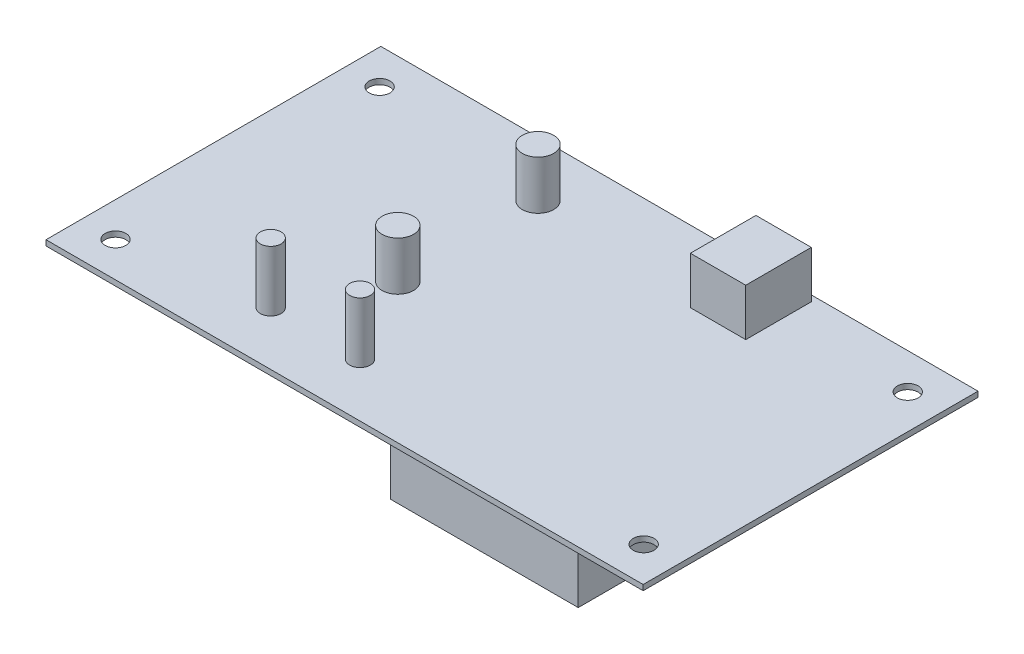
ISO-10303-21;
HEADER;
FILE_DESCRIPTION(('STEP AP214'),'2;1');
FILE_NAME('part.step','',(''),(''),'','','');
FILE_SCHEMA(('AUTOMOTIVE_DESIGN { 1 0 10303 214 1 1 1 1 }'));
ENDSEC;
DATA;
#1=APPLICATION_CONTEXT('core data for automotive mechanical design processes');
#2=APPLICATION_PROTOCOL_DEFINITION('international standard','automotive_design',2000,#1);
#3=PRODUCT_CONTEXT('',#1,'mechanical');
#4=PRODUCT('Part','Part','',(#3));
#5=PRODUCT_RELATED_PRODUCT_CATEGORY('part','',(#4));
#6=PRODUCT_DEFINITION_FORMATION('','',#4);
#7=PRODUCT_DEFINITION_CONTEXT('part definition',#1,'design');
#8=PRODUCT_DEFINITION('design','',#6,#7);
#9=PRODUCT_DEFINITION_SHAPE('','',#8);
#10=(LENGTH_UNIT() NAMED_UNIT(*) SI_UNIT(.MILLI.,.METRE.));
#11=(NAMED_UNIT(*) PLANE_ANGLE_UNIT() SI_UNIT($,.RADIAN.));
#12=(NAMED_UNIT(*) SI_UNIT($,.STERADIAN.) SOLID_ANGLE_UNIT());
#13=UNCERTAINTY_MEASURE_WITH_UNIT(LENGTH_MEASURE(1.E-05),#10,'distance_accuracy_value','');
#14=(GEOMETRIC_REPRESENTATION_CONTEXT(3) GLOBAL_UNCERTAINTY_ASSIGNED_CONTEXT((#13)) GLOBAL_UNIT_ASSIGNED_CONTEXT((#10,
#11,#12)) REPRESENTATION_CONTEXT('',''));
#15=CARTESIAN_POINT('',(0.,0.,0.));
#16=DIRECTION('',(0.,0.,1.));
#17=DIRECTION('',(1.,0.,0.));
#18=AXIS2_PLACEMENT_3D('',#15,#16,#17);
#19=CARTESIAN_POINT('',(0.,1.5494,0.));
#20=DIRECTION('',(0.,-1.,0.));
#21=DIRECTION('',(0.,0.,-1.));
#22=AXIS2_PLACEMENT_3D('',#19,#20,#21);
#23=PLANE('',#22);
#24=CARTESIAN_POINT('',(9.81075,1.5494,-9.96315));
#25=DIRECTION('',(0.,1.,0.));
#26=DIRECTION('',(0.,0.,1.));
#27=AXIS2_PLACEMENT_3D('',#24,#25,#26);
#28=CIRCLE('',#27,2.95275);
#29=CARTESIAN_POINT('',(9.81075,1.5494,-7.0104));
#30=VERTEX_POINT('',#29);
#31=EDGE_CURVE('E564',#30,#30,#28,.T.);
#32=ORIENTED_EDGE('',*,*,#31,.F.);
#33=EDGE_LOOP('',(#32));
#34=FACE_BOUND('',#33,.T.);
#35=CARTESIAN_POINT('',(160.05175,1.5494,-9.96315));
#36=DIRECTION('',(0.,1.,0.));
#37=DIRECTION('',(0.,0.,1.));
#38=AXIS2_PLACEMENT_3D('',#35,#36,#37);
#39=CIRCLE('',#38,2.95275000000001);
#40=CARTESIAN_POINT('',(160.05175,1.5494,-7.01039999999999));
#41=VERTEX_POINT('',#40);
#42=EDGE_CURVE('E565',#41,#41,#39,.T.);
#43=ORIENTED_EDGE('',*,*,#42,.F.);
#44=EDGE_LOOP('',(#43));
#45=FACE_BOUND('',#44,.T.);
#46=CARTESIAN_POINT('',(160.05175,1.5494,-85.08365));
#47=DIRECTION('',(0.,1.,0.));
#48=DIRECTION('',(0.,0.,1.));
#49=AXIS2_PLACEMENT_3D('',#46,#47,#48);
#50=CIRCLE('',#49,2.95275000000001);
#51=CARTESIAN_POINT('',(160.05175,1.5494,-82.1309));
#52=VERTEX_POINT('',#51);
#53=EDGE_CURVE('E568',#52,#52,#50,.T.);
#54=ORIENTED_EDGE('',*,*,#53,.F.);
#55=EDGE_LOOP('',(#54));
#56=FACE_BOUND('',#55,.T.);
#57=CARTESIAN_POINT('',(9.81075,1.5494,-85.08365));
#58=DIRECTION('',(0.,1.,0.));
#59=DIRECTION('',(0.,0.,1.));
#60=AXIS2_PLACEMENT_3D('',#57,#58,#59);
#61=CIRCLE('',#60,2.95275);
#62=CARTESIAN_POINT('',(9.81075,1.5494,-82.1309));
#63=VERTEX_POINT('',#62);
#64=EDGE_CURVE('E236',#63,#63,#61,.T.);
#65=ORIENTED_EDGE('',*,*,#64,.F.);
#66=EDGE_LOOP('',(#65));
#67=FACE_BOUND('',#66,.T.);
#68=CARTESIAN_POINT('',(74.0791,1.5494,-15.24));
#69=DIRECTION('',(0.,-1.,0.));
#70=DIRECTION('',(0.,0.,-1.));
#71=AXIS2_PLACEMENT_3D('',#68,#69,#70);
#72=CIRCLE('',#71,2.95275);
#73=CARTESIAN_POINT('',(74.0791,1.5494,-18.19275));
#74=VERTEX_POINT('',#73);
#75=EDGE_CURVE('E11',#74,#74,#72,.F.);
#76=ORIENTED_EDGE('',*,*,#75,.F.);
#77=EDGE_LOOP('',(#76));
#78=FACE_BOUND('',#77,.T.);
#79=CARTESIAN_POINT('',(48.6791,1.5494,-15.24));
#80=DIRECTION('',(0.,-1.,0.));
#81=DIRECTION('',(0.,0.,-1.));
#82=AXIS2_PLACEMENT_3D('',#79,#80,#81);
#83=CIRCLE('',#82,2.95275);
#84=CARTESIAN_POINT('',(48.6791,1.5494,-18.19275));
#85=VERTEX_POINT('',#84);
#86=EDGE_CURVE('E42',#85,#85,#83,.F.);
#87=ORIENTED_EDGE('',*,*,#86,.F.);
#88=EDGE_LOOP('',(#87));
#89=FACE_BOUND('',#88,.T.);
#90=CARTESIAN_POINT('',(60.325,1.5494,-39.751));
#91=DIRECTION('',(0.,-1.,0.));
#92=DIRECTION('',(0.,0.,-1.));
#93=AXIS2_PLACEMENT_3D('',#90,#91,#92);
#94=CIRCLE('',#93,4.47040000000001);
#95=CARTESIAN_POINT('',(60.325,1.5494,-44.2214));
#96=VERTEX_POINT('',#95);
#97=EDGE_CURVE('E227',#96,#96,#94,.F.);
#98=ORIENTED_EDGE('',*,*,#97,.F.);
#99=EDGE_LOOP('',(#98));
#100=FACE_BOUND('',#99,.T.);
#101=CARTESIAN_POINT('',(60.325,1.5494,-79.629));
#102=DIRECTION('',(0.,-1.,0.));
#103=DIRECTION('',(0.,0.,-1.));
#104=AXIS2_PLACEMENT_3D('',#101,#102,#103);
#105=CIRCLE('',#104,4.47040000000001);
#106=CARTESIAN_POINT('',(60.325,1.5494,-84.0994));
#107=VERTEX_POINT('',#106);
#108=EDGE_CURVE('E224',#107,#107,#105,.F.);
#109=ORIENTED_EDGE('',*,*,#108,.F.);
#110=EDGE_LOOP('',(#109));
#111=FACE_BOUND('',#110,.T.);
#112=DIRECTION('',(0.,0.,1.));
#113=VECTOR('',#112,1.);
#114=CARTESIAN_POINT('',(0.,1.5494,0.));
#115=LINE('',#114,#113);
#116=CARTESIAN_POINT('',(0.,1.5494,-95.25));
#117=VERTEX_POINT('',#116);
#118=CARTESIAN_POINT('',(0.,1.5494,0.));
#119=VERTEX_POINT('',#118);
#120=EDGE_CURVE('E195',#117,#119,#115,.T.);
#121=ORIENTED_EDGE('',*,*,#120,.T.);
#122=DIRECTION('',(1.,0.,0.));
#123=VECTOR('',#122,1.);
#124=CARTESIAN_POINT('',(0.,1.5494,0.));
#125=LINE('',#124,#123);
#126=CARTESIAN_POINT('',(169.8625,1.5494,0.));
#127=VERTEX_POINT('',#126);
#128=EDGE_CURVE('E198',#119,#127,#125,.T.);
#129=ORIENTED_EDGE('',*,*,#128,.T.);
#130=DIRECTION('',(0.,0.,-1.));
#131=VECTOR('',#130,1.);
#132=CARTESIAN_POINT('',(169.8625,1.5494,0.));
#133=LINE('',#132,#131);
#134=CARTESIAN_POINT('',(169.8625,1.5494,-95.25));
#135=VERTEX_POINT('',#134);
#136=EDGE_CURVE('E201',#127,#135,#133,.T.);
#137=ORIENTED_EDGE('',*,*,#136,.T.);
#138=DIRECTION('',(-1.,0.,0.));
#139=VECTOR('',#138,1.);
#140=CARTESIAN_POINT('',(0.,1.5494,-95.25));
#141=LINE('',#140,#139);
#142=EDGE_CURVE('E203',#135,#117,#141,.T.);
#143=ORIENTED_EDGE('',*,*,#142,.T.);
#144=EDGE_LOOP('',(#121,#129,#137,#143));
#145=FACE_BOUND('',#144,.T.);
#146=DIRECTION('',(0.,0.,1.));
#147=VECTOR('',#146,1.);
#148=CARTESIAN_POINT('',(108.3945,1.5494,-93.5482));
#149=LINE('',#148,#147);
#150=CARTESIAN_POINT('',(108.3945,1.5494,-93.5482));
#151=VERTEX_POINT('',#150);
#152=CARTESIAN_POINT('',(108.3945,1.5494,-74.9046));
#153=VERTEX_POINT('',#152);
#154=EDGE_CURVE('E161',#151,#153,#149,.T.);
#155=ORIENTED_EDGE('',*,*,#154,.F.);
#156=DIRECTION('',(-1.,0.,0.));
#157=VECTOR('',#156,1.);
#158=CARTESIAN_POINT('',(108.3945,1.5494,-93.5482));
#159=LINE('',#158,#157);
#160=CARTESIAN_POINT('',(124.1425,1.5494,-93.5482));
#161=VERTEX_POINT('',#160);
#162=EDGE_CURVE('E166',#161,#151,#159,.T.);
#163=ORIENTED_EDGE('',*,*,#162,.F.);
#164=DIRECTION('',(0.,0.,-1.));
#165=VECTOR('',#164,1.);
#166=CARTESIAN_POINT('',(124.1425,1.5494,-93.5482));
#167=LINE('',#166,#165);
#168=CARTESIAN_POINT('',(124.1425,1.5494,-74.9046));
#169=VERTEX_POINT('',#168);
#170=EDGE_CURVE('E178',#169,#161,#167,.T.);
#171=ORIENTED_EDGE('',*,*,#170,.F.);
#172=DIRECTION('',(1.,0.,0.));
#173=VECTOR('',#172,1.);
#174=CARTESIAN_POINT('',(108.3945,1.5494,-74.9046));
#175=LINE('',#174,#173);
#176=EDGE_CURVE('E175',#153,#169,#175,.T.);
#177=ORIENTED_EDGE('',*,*,#176,.F.);
#178=EDGE_LOOP('',(#155,#163,#171,#177));
#179=FACE_BOUND('',#178,.T.);
#180=ADVANCED_FACE('F33',(#34,#45,#56,#67,#78,#89,#100,#111,#145,#179),#23,.F.);
#181=CARTESIAN_POINT('',(0.,1.5494,0.));
#182=DIRECTION('',(1.,0.,0.));
#183=DIRECTION('',(0.,0.,-1.));
#184=AXIS2_PLACEMENT_3D('',#181,#182,#183);
#185=PLANE('',#184);
#186=DIRECTION('',(0.,0.,1.));
#187=VECTOR('',#186,1.);
#188=CARTESIAN_POINT('',(0.,0.,0.));
#189=LINE('',#188,#187);
#190=CARTESIAN_POINT('',(0.,0.,-95.25));
#191=VERTEX_POINT('',#190);
#192=CARTESIAN_POINT('',(0.,0.,0.));
#193=VERTEX_POINT('',#192);
#194=EDGE_CURVE('E194',#191,#193,#189,.T.);
#195=ORIENTED_EDGE('',*,*,#194,.T.);
#196=DIRECTION('',(0.,-1.,0.));
#197=VECTOR('',#196,1.);
#198=CARTESIAN_POINT('',(0.,1.5494,0.));
#199=LINE('',#198,#197);
#200=EDGE_CURVE('E221',#119,#193,#199,.T.);
#201=ORIENTED_EDGE('',*,*,#200,.F.);
#202=ORIENTED_EDGE('',*,*,#120,.F.);
#203=DIRECTION('',(0.,-1.,0.));
#204=VECTOR('',#203,1.);
#205=CARTESIAN_POINT('',(0.,1.5494,-95.25));
#206=LINE('',#205,#204);
#207=EDGE_CURVE('E205',#117,#191,#206,.T.);
#208=ORIENTED_EDGE('',*,*,#207,.T.);
#209=EDGE_LOOP('',(#195,#201,#202,#208));
#210=FACE_BOUND('',#209,.T.);
#211=ADVANCED_FACE('F35',(#210),#185,.F.);
#212=CARTESIAN_POINT('',(0.,1.5494,0.));
#213=DIRECTION('',(0.,0.,-1.));
#214=DIRECTION('',(-1.,0.,0.));
#215=AXIS2_PLACEMENT_3D('',#212,#213,#214);
#216=PLANE('',#215);
#217=DIRECTION('',(1.,0.,0.));
#218=VECTOR('',#217,1.);
#219=CARTESIAN_POINT('',(0.,0.,0.));
#220=LINE('',#219,#218);
#221=CARTESIAN_POINT('',(169.8625,0.,0.));
#222=VERTEX_POINT('',#221);
#223=EDGE_CURVE('E208',#193,#222,#220,.T.);
#224=ORIENTED_EDGE('',*,*,#223,.T.);
#225=DIRECTION('',(0.,-1.,0.));
#226=VECTOR('',#225,1.);
#227=CARTESIAN_POINT('',(169.8625,1.5494,0.));
#228=LINE('',#227,#226);
#229=EDGE_CURVE('E218',#127,#222,#228,.T.);
#230=ORIENTED_EDGE('',*,*,#229,.F.);
#231=ORIENTED_EDGE('',*,*,#128,.F.);
#232=ORIENTED_EDGE('',*,*,#200,.T.);
#233=EDGE_LOOP('',(#224,#230,#231,#232));
#234=FACE_BOUND('',#233,.T.);
#235=ADVANCED_FACE('F283',(#234),#216,.F.);
#236=CARTESIAN_POINT('',(169.8625,1.5494,0.));
#237=DIRECTION('',(-1.,0.,0.));
#238=DIRECTION('',(0.,0.,1.));
#239=AXIS2_PLACEMENT_3D('',#236,#237,#238);
#240=PLANE('',#239);
#241=DIRECTION('',(0.,0.,-1.));
#242=VECTOR('',#241,1.);
#243=CARTESIAN_POINT('',(169.8625,0.,0.));
#244=LINE('',#243,#242);
#245=CARTESIAN_POINT('',(169.8625,0.,-95.25));
#246=VERTEX_POINT('',#245);
#247=EDGE_CURVE('E210',#222,#246,#244,.T.);
#248=ORIENTED_EDGE('',*,*,#247,.T.);
#249=DIRECTION('',(0.,-1.,0.));
#250=VECTOR('',#249,1.);
#251=CARTESIAN_POINT('',(169.8625,1.5494,-95.25));
#252=LINE('',#251,#250);
#253=EDGE_CURVE('E215',#135,#246,#252,.T.);
#254=ORIENTED_EDGE('',*,*,#253,.F.);
#255=ORIENTED_EDGE('',*,*,#136,.F.);
#256=ORIENTED_EDGE('',*,*,#229,.T.);
#257=EDGE_LOOP('',(#248,#254,#255,#256));
#258=FACE_BOUND('',#257,.T.);
#259=ADVANCED_FACE('F280',(#258),#240,.F.);
#260=CARTESIAN_POINT('',(0.,1.5494,-95.25));
#261=DIRECTION('',(0.,0.,1.));
#262=DIRECTION('',(1.,0.,0.));
#263=AXIS2_PLACEMENT_3D('',#260,#261,#262);
#264=PLANE('',#263);
#265=DIRECTION('',(-1.,0.,0.));
#266=VECTOR('',#265,1.);
#267=CARTESIAN_POINT('',(0.,0.,-95.25));
#268=LINE('',#267,#266);
#269=EDGE_CURVE('E199',#246,#191,#268,.T.);
#270=ORIENTED_EDGE('',*,*,#269,.T.);
#271=ORIENTED_EDGE('',*,*,#207,.F.);
#272=ORIENTED_EDGE('',*,*,#142,.F.);
#273=ORIENTED_EDGE('',*,*,#253,.T.);
#274=EDGE_LOOP('',(#270,#271,#272,#273));
#275=FACE_BOUND('',#274,.T.);
#276=ADVANCED_FACE('F265',(#275),#264,.F.);
#277=CARTESIAN_POINT('',(0.,0.,0.));
#278=DIRECTION('',(0.,-1.,0.));
#279=DIRECTION('',(0.,0.,-1.));
#280=AXIS2_PLACEMENT_3D('',#277,#278,#279);
#281=PLANE('',#280);
#282=CARTESIAN_POINT('',(9.81075,0.,-9.96315));
#283=DIRECTION('',(0.,-1.,0.));
#284=DIRECTION('',(0.,0.,-1.));
#285=AXIS2_PLACEMENT_3D('',#282,#283,#284);
#286=CIRCLE('',#285,2.95275);
#287=CARTESIAN_POINT('',(9.81075,0.,-12.9159));
#288=VERTEX_POINT('',#287);
#289=EDGE_CURVE('E37',#288,#288,#286,.T.);
#290=ORIENTED_EDGE('',*,*,#289,.F.);
#291=EDGE_LOOP('',(#290));
#292=FACE_BOUND('',#291,.T.);
#293=CARTESIAN_POINT('',(160.05175,0.,-9.96315));
#294=DIRECTION('',(0.,-1.,0.));
#295=DIRECTION('',(0.,0.,-1.));
#296=AXIS2_PLACEMENT_3D('',#293,#294,#295);
#297=CIRCLE('',#296,2.95275000000001);
#298=CARTESIAN_POINT('',(160.05175,0.,-12.9159));
#299=VERTEX_POINT('',#298);
#300=EDGE_CURVE('E238',#299,#299,#297,.T.);
#301=ORIENTED_EDGE('',*,*,#300,.F.);
#302=EDGE_LOOP('',(#301));
#303=FACE_BOUND('',#302,.T.);
#304=CARTESIAN_POINT('',(160.05175,0.,-85.08365));
#305=DIRECTION('',(0.,-1.,0.));
#306=DIRECTION('',(0.,0.,-1.));
#307=AXIS2_PLACEMENT_3D('',#304,#305,#306);
#308=CIRCLE('',#307,2.95275000000001);
#309=CARTESIAN_POINT('',(160.05175,0.,-88.0364));
#310=VERTEX_POINT('',#309);
#311=EDGE_CURVE('E235',#310,#310,#308,.T.);
#312=ORIENTED_EDGE('',*,*,#311,.F.);
#313=EDGE_LOOP('',(#312));
#314=FACE_BOUND('',#313,.T.);
#315=CARTESIAN_POINT('',(9.81075,0.,-85.08365));
#316=DIRECTION('',(0.,-1.,0.));
#317=DIRECTION('',(0.,0.,-1.));
#318=AXIS2_PLACEMENT_3D('',#315,#316,#317);
#319=CIRCLE('',#318,2.95275);
#320=CARTESIAN_POINT('',(9.81075,0.,-88.0364));
#321=VERTEX_POINT('',#320);
#322=EDGE_CURVE('E232',#321,#321,#319,.T.);
#323=ORIENTED_EDGE('',*,*,#322,.F.);
#324=EDGE_LOOP('',(#323));
#325=FACE_BOUND('',#324,.T.);
#326=DIRECTION('',(0.,0.,-1.));
#327=VECTOR('',#326,1.);
#328=CARTESIAN_POINT('',(96.9645,0.,-1.0922));
#329=LINE('',#328,#327);
#330=CARTESIAN_POINT('',(96.9645,0.,-1.0922));
#331=VERTEX_POINT('',#330);
#332=CARTESIAN_POINT('',(96.9645,0.,-69.6722));
#333=VERTEX_POINT('',#332);
#334=EDGE_CURVE('E50',#331,#333,#329,.T.);
#335=ORIENTED_EDGE('',*,*,#334,.F.);
#336=DIRECTION('',(-1.,0.,0.));
#337=VECTOR('',#336,1.);
#338=CARTESIAN_POINT('',(96.9645,0.,-1.0922));
#339=LINE('',#338,#337);
#340=CARTESIAN_POINT('',(150.3045,0.,-1.09219999999999));
#341=VERTEX_POINT('',#340);
#342=EDGE_CURVE('E54',#341,#331,#339,.T.);
#343=ORIENTED_EDGE('',*,*,#342,.F.);
#344=DIRECTION('',(0.,0.,1.));
#345=VECTOR('',#344,1.);
#346=CARTESIAN_POINT('',(150.3045,0.,-1.09219999999999));
#347=LINE('',#346,#345);
#348=CARTESIAN_POINT('',(150.3045,0.,-69.6722));
#349=VERTEX_POINT('',#348);
#350=EDGE_CURVE('E247',#349,#341,#347,.T.);
#351=ORIENTED_EDGE('',*,*,#350,.F.);
#352=DIRECTION('',(1.,0.,0.));
#353=VECTOR('',#352,1.);
#354=CARTESIAN_POINT('',(96.9645,0.,-69.6722));
#355=LINE('',#354,#353);
#356=EDGE_CURVE('E245',#333,#349,#355,.T.);
#357=ORIENTED_EDGE('',*,*,#356,.F.);
#358=EDGE_LOOP('',(#335,#343,#351,#357));
#359=FACE_BOUND('',#358,.T.);
#360=ORIENTED_EDGE('',*,*,#194,.F.);
#361=ORIENTED_EDGE('',*,*,#269,.F.);
#362=ORIENTED_EDGE('',*,*,#247,.F.);
#363=ORIENTED_EDGE('',*,*,#223,.F.);
#364=EDGE_LOOP('',(#360,#361,#362,#363));
#365=FACE_BOUND('',#364,.T.);
#366=ADVANCED_FACE('F261',(#292,#303,#314,#325,#359,#365),#281,.T.);
#367=CARTESIAN_POINT('',(108.3945,14.9606,-93.5482));
#368=DIRECTION('',(1.,0.,0.));
#369=DIRECTION('',(0.,0.,-1.));
#370=AXIS2_PLACEMENT_3D('',#367,#368,#369);
#371=PLANE('',#370);
#372=ORIENTED_EDGE('',*,*,#154,.T.);
#373=DIRECTION('',(0.,-1.,0.));
#374=VECTOR('',#373,1.);
#375=CARTESIAN_POINT('',(108.3945,14.9606,-74.9046));
#376=LINE('',#375,#374);
#377=CARTESIAN_POINT('',(108.3945,14.9606,-74.9046));
#378=VERTEX_POINT('',#377);
#379=EDGE_CURVE('E191',#378,#153,#376,.T.);
#380=ORIENTED_EDGE('',*,*,#379,.F.);
#381=DIRECTION('',(0.,0.,1.));
#382=VECTOR('',#381,1.);
#383=CARTESIAN_POINT('',(108.3945,14.9606,-93.5482));
#384=LINE('',#383,#382);
#385=CARTESIAN_POINT('',(108.3945,14.9606,-93.5482));
#386=VERTEX_POINT('',#385);
#387=EDGE_CURVE('E162',#386,#378,#384,.T.);
#388=ORIENTED_EDGE('',*,*,#387,.F.);
#389=DIRECTION('',(0.,-1.,0.));
#390=VECTOR('',#389,1.);
#391=CARTESIAN_POINT('',(108.3945,14.9606,-93.5482));
#392=LINE('',#391,#390);
#393=EDGE_CURVE('E172',#386,#151,#392,.T.);
#394=ORIENTED_EDGE('',*,*,#393,.T.);
#395=EDGE_LOOP('',(#372,#380,#388,#394));
#396=FACE_BOUND('',#395,.T.);
#397=ADVANCED_FACE('F264',(#396),#371,.F.);
#398=CARTESIAN_POINT('',(108.3945,14.9606,-74.9046));
#399=DIRECTION('',(0.,0.,-1.));
#400=DIRECTION('',(-1.,0.,0.));
#401=AXIS2_PLACEMENT_3D('',#398,#399,#400);
#402=PLANE('',#401);
#403=ORIENTED_EDGE('',*,*,#176,.T.);
#404=DIRECTION('',(0.,-1.,0.));
#405=VECTOR('',#404,1.);
#406=CARTESIAN_POINT('',(124.1425,14.9606,-74.9046));
#407=LINE('',#406,#405);
#408=CARTESIAN_POINT('',(124.1425,14.9606,-74.9046));
#409=VERTEX_POINT('',#408);
#410=EDGE_CURVE('E188',#409,#169,#407,.T.);
#411=ORIENTED_EDGE('',*,*,#410,.F.);
#412=DIRECTION('',(1.,0.,0.));
#413=VECTOR('',#412,1.);
#414=CARTESIAN_POINT('',(108.3945,14.9606,-74.9046));
#415=LINE('',#414,#413);
#416=EDGE_CURVE('E165',#378,#409,#415,.T.);
#417=ORIENTED_EDGE('',*,*,#416,.F.);
#418=ORIENTED_EDGE('',*,*,#379,.T.);
#419=EDGE_LOOP('',(#403,#411,#417,#418));
#420=FACE_BOUND('',#419,.T.);
#421=ADVANCED_FACE('F304',(#420),#402,.F.);
#422=CARTESIAN_POINT('',(124.1425,14.9606,-93.5482));
#423=DIRECTION('',(-1.,0.,0.));
#424=DIRECTION('',(0.,0.,1.));
#425=AXIS2_PLACEMENT_3D('',#422,#423,#424);
#426=PLANE('',#425);
#427=ORIENTED_EDGE('',*,*,#170,.T.);
#428=DIRECTION('',(0.,-1.,0.));
#429=VECTOR('',#428,1.);
#430=CARTESIAN_POINT('',(124.1425,14.9606,-93.5482));
#431=LINE('',#430,#429);
#432=CARTESIAN_POINT('',(124.1425,14.9606,-93.5482));
#433=VERTEX_POINT('',#432);
#434=EDGE_CURVE('E185',#433,#161,#431,.T.);
#435=ORIENTED_EDGE('',*,*,#434,.F.);
#436=DIRECTION('',(0.,0.,-1.));
#437=VECTOR('',#436,1.);
#438=CARTESIAN_POINT('',(124.1425,14.9606,-93.5482));
#439=LINE('',#438,#437);
#440=EDGE_CURVE('E168',#409,#433,#439,.T.);
#441=ORIENTED_EDGE('',*,*,#440,.F.);
#442=ORIENTED_EDGE('',*,*,#410,.T.);
#443=EDGE_LOOP('',(#427,#435,#441,#442));
#444=FACE_BOUND('',#443,.T.);
#445=ADVANCED_FACE('F302',(#444),#426,.F.);
#446=CARTESIAN_POINT('',(108.3945,14.9606,-93.5482));
#447=DIRECTION('',(0.,0.,1.));
#448=DIRECTION('',(1.,0.,0.));
#449=AXIS2_PLACEMENT_3D('',#446,#447,#448);
#450=PLANE('',#449);
#451=ORIENTED_EDGE('',*,*,#162,.T.);
#452=ORIENTED_EDGE('',*,*,#393,.F.);
#453=DIRECTION('',(-1.,0.,0.));
#454=VECTOR('',#453,1.);
#455=CARTESIAN_POINT('',(108.3945,14.9606,-93.5482));
#456=LINE('',#455,#454);
#457=EDGE_CURVE('E170',#433,#386,#456,.T.);
#458=ORIENTED_EDGE('',*,*,#457,.F.);
#459=ORIENTED_EDGE('',*,*,#434,.T.);
#460=EDGE_LOOP('',(#451,#452,#458,#459));
#461=FACE_BOUND('',#460,.T.);
#462=ADVANCED_FACE('F293',(#461),#450,.F.);
#463=CARTESIAN_POINT('',(0.,14.9606,0.));
#464=DIRECTION('',(0.,1.,0.));
#465=DIRECTION('',(0.,0.,1.));
#466=AXIS2_PLACEMENT_3D('',#463,#464,#465);
#467=PLANE('',#466);
#468=ORIENTED_EDGE('',*,*,#387,.T.);
#469=ORIENTED_EDGE('',*,*,#416,.T.);
#470=ORIENTED_EDGE('',*,*,#440,.T.);
#471=ORIENTED_EDGE('',*,*,#457,.T.);
#472=EDGE_LOOP('',(#468,#469,#470,#471));
#473=FACE_BOUND('',#472,.T.);
#474=ADVANCED_FACE('F298',(#473),#467,.T.);
#475=CARTESIAN_POINT('',(60.325,15.3924,-79.629));
#476=DIRECTION('',(0.,-1.,0.));
#477=DIRECTION('',(0.,0.,-1.));
#478=AXIS2_PLACEMENT_3D('',#475,#476,#477);
#479=CYLINDRICAL_SURFACE('',#478,4.47040000000001);
#480=CARTESIAN_POINT('',(60.325,15.3924,-79.629));
#481=DIRECTION('',(0.,1.,0.));
#482=DIRECTION('',(0.,0.,1.));
#483=AXIS2_PLACEMENT_3D('',#480,#481,#482);
#484=CIRCLE('',#483,4.47040000000001);
#485=CARTESIAN_POINT('',(60.325,15.3924,-75.1586));
#486=VERTEX_POINT('',#485);
#487=EDGE_CURVE('E158',#486,#486,#484,.T.);
#488=ORIENTED_EDGE('',*,*,#487,.F.);
#489=EDGE_LOOP('',(#488));
#490=FACE_BOUND('',#489,.T.);
#491=ORIENTED_EDGE('',*,*,#108,.T.);
#492=EDGE_LOOP('',(#491));
#493=FACE_BOUND('',#492,.T.);
#494=ADVANCED_FACE('F421',(#490,#493),#479,.T.);
#495=CARTESIAN_POINT('',(60.325,15.3924,-79.629));
#496=DIRECTION('',(0.,1.,0.));
#497=DIRECTION('',(0.,0.,1.));
#498=AXIS2_PLACEMENT_3D('',#495,#496,#497);
#499=PLANE('',#498);
#500=ORIENTED_EDGE('',*,*,#487,.T.);
#501=EDGE_LOOP('',(#500));
#502=FACE_BOUND('',#501,.T.);
#503=ADVANCED_FACE('F417',(#502),#499,.T.);
#504=CARTESIAN_POINT('',(60.325,15.3924,-39.751));
#505=DIRECTION('',(0.,-1.,0.));
#506=DIRECTION('',(0.,0.,-1.));
#507=AXIS2_PLACEMENT_3D('',#504,#505,#506);
#508=CYLINDRICAL_SURFACE('',#507,4.47040000000001);
#509=CARTESIAN_POINT('',(60.325,15.3924,-39.751));
#510=DIRECTION('',(0.,1.,0.));
#511=DIRECTION('',(0.,0.,1.));
#512=AXIS2_PLACEMENT_3D('',#509,#510,#511);
#513=CIRCLE('',#512,4.47040000000001);
#514=CARTESIAN_POINT('',(60.325,15.3924,-35.2806));
#515=VERTEX_POINT('',#514);
#516=EDGE_CURVE('E155',#515,#515,#513,.T.);
#517=ORIENTED_EDGE('',*,*,#516,.F.);
#518=EDGE_LOOP('',(#517));
#519=FACE_BOUND('',#518,.T.);
#520=ORIENTED_EDGE('',*,*,#97,.T.);
#521=EDGE_LOOP('',(#520));
#522=FACE_BOUND('',#521,.T.);
#523=ADVANCED_FACE('F413',(#519,#522),#508,.T.);
#524=CARTESIAN_POINT('',(60.325,15.3924,-39.751));
#525=DIRECTION('',(0.,1.,0.));
#526=DIRECTION('',(0.,0.,1.));
#527=AXIS2_PLACEMENT_3D('',#524,#525,#526);
#528=PLANE('',#527);
#529=ORIENTED_EDGE('',*,*,#516,.T.);
#530=EDGE_LOOP('',(#529));
#531=FACE_BOUND('',#530,.T.);
#532=ADVANCED_FACE('F409',(#531),#528,.T.);
#533=CARTESIAN_POINT('',(48.6791,18.7198,-15.24));
#534=DIRECTION('',(0.,-1.,0.));
#535=DIRECTION('',(0.,0.,-1.));
#536=AXIS2_PLACEMENT_3D('',#533,#534,#535);
#537=CYLINDRICAL_SURFACE('',#536,2.95275);
#538=CARTESIAN_POINT('',(48.6791,18.7198,-15.24));
#539=DIRECTION('',(0.,1.,0.));
#540=DIRECTION('',(0.,0.,1.));
#541=AXIS2_PLACEMENT_3D('',#538,#539,#540);
#542=CIRCLE('',#541,2.95275);
#543=CARTESIAN_POINT('',(48.6791,18.7198,-12.28725));
#544=VERTEX_POINT('',#543);
#545=EDGE_CURVE('E147',#544,#544,#542,.T.);
#546=ORIENTED_EDGE('',*,*,#545,.F.);
#547=EDGE_LOOP('',(#546));
#548=FACE_BOUND('',#547,.T.);
#549=ORIENTED_EDGE('',*,*,#86,.T.);
#550=EDGE_LOOP('',(#549));
#551=FACE_BOUND('',#550,.T.);
#552=ADVANCED_FACE('F405',(#548,#551),#537,.T.);
#553=CARTESIAN_POINT('',(48.6791,18.7198,-15.24));
#554=DIRECTION('',(0.,1.,0.));
#555=DIRECTION('',(0.,0.,1.));
#556=AXIS2_PLACEMENT_3D('',#553,#554,#555);
#557=PLANE('',#556);
#558=ORIENTED_EDGE('',*,*,#545,.T.);
#559=EDGE_LOOP('',(#558));
#560=FACE_BOUND('',#559,.T.);
#561=ADVANCED_FACE('F401',(#560),#557,.T.);
#562=CARTESIAN_POINT('',(74.0791,18.7198,-15.24));
#563=DIRECTION('',(0.,-1.,0.));
#564=DIRECTION('',(0.,0.,-1.));
#565=AXIS2_PLACEMENT_3D('',#562,#563,#564);
#566=CYLINDRICAL_SURFACE('',#565,2.95275);
#567=CARTESIAN_POINT('',(74.0791,18.7198,-15.24));
#568=DIRECTION('',(0.,1.,0.));
#569=DIRECTION('',(0.,0.,1.));
#570=AXIS2_PLACEMENT_3D('',#567,#568,#569);
#571=CIRCLE('',#570,2.95275);
#572=CARTESIAN_POINT('',(74.0791,18.7198,-12.28725));
#573=VERTEX_POINT('',#572);
#574=EDGE_CURVE('E144',#573,#573,#571,.T.);
#575=ORIENTED_EDGE('',*,*,#574,.F.);
#576=EDGE_LOOP('',(#575));
#577=FACE_BOUND('',#576,.T.);
#578=ORIENTED_EDGE('',*,*,#75,.T.);
#579=EDGE_LOOP('',(#578));
#580=FACE_BOUND('',#579,.T.);
#581=ADVANCED_FACE('F397',(#577,#580),#566,.T.);
#582=CARTESIAN_POINT('',(74.0791,18.7198,-15.24));
#583=DIRECTION('',(0.,1.,0.));
#584=DIRECTION('',(0.,0.,1.));
#585=AXIS2_PLACEMENT_3D('',#582,#583,#584);
#586=PLANE('',#585);
#587=ORIENTED_EDGE('',*,*,#574,.T.);
#588=EDGE_LOOP('',(#587));
#589=FACE_BOUND('',#588,.T.);
#590=ADVANCED_FACE('F394',(#589),#586,.T.);
#591=CARTESIAN_POINT('',(96.9645,-14.478,-1.0922));
#592=DIRECTION('',(1.,0.,0.));
#593=DIRECTION('',(0.,0.,-1.));
#594=AXIS2_PLACEMENT_3D('',#591,#592,#593);
#595=PLANE('',#594);
#596=ORIENTED_EDGE('',*,*,#334,.T.);
#597=DIRECTION('',(0.,1.,0.));
#598=VECTOR('',#597,1.);
#599=CARTESIAN_POINT('',(96.9645,-14.478,-69.6722));
#600=LINE('',#599,#598);
#601=CARTESIAN_POINT('',(96.9645,-14.478,-69.6722));
#602=VERTEX_POINT('',#601);
#603=EDGE_CURVE('E127',#602,#333,#600,.T.);
#604=ORIENTED_EDGE('',*,*,#603,.F.);
#605=DIRECTION('',(0.,0.,-1.));
#606=VECTOR('',#605,1.);
#607=CARTESIAN_POINT('',(96.9645,-14.478,-1.0922));
#608=LINE('',#607,#606);
#609=CARTESIAN_POINT('',(96.9645,-14.478,-1.0922));
#610=VERTEX_POINT('',#609);
#611=EDGE_CURVE('E133',#610,#602,#608,.T.);
#612=ORIENTED_EDGE('',*,*,#611,.F.);
#613=DIRECTION('',(0.,1.,0.));
#614=VECTOR('',#613,1.);
#615=CARTESIAN_POINT('',(96.9645,-14.478,-1.0922));
#616=LINE('',#615,#614);
#617=EDGE_CURVE('E254',#610,#331,#616,.T.);
#618=ORIENTED_EDGE('',*,*,#617,.T.);
#619=EDGE_LOOP('',(#596,#604,#612,#618));
#620=FACE_BOUND('',#619,.T.);
#621=ADVANCED_FACE('F143',(#620),#595,.F.);
#622=CARTESIAN_POINT('',(96.9645,-14.478,-69.6722));
#623=DIRECTION('',(0.,0.,1.));
#624=DIRECTION('',(1.,0.,0.));
#625=AXIS2_PLACEMENT_3D('',#622,#623,#624);
#626=PLANE('',#625);
#627=ORIENTED_EDGE('',*,*,#356,.T.);
#628=DIRECTION('',(0.,1.,0.));
#629=VECTOR('',#628,1.);
#630=CARTESIAN_POINT('',(150.3045,-14.478,-69.6722));
#631=LINE('',#630,#629);
#632=CARTESIAN_POINT('',(150.3045,-14.478,-69.6722));
#633=VERTEX_POINT('',#632);
#634=EDGE_CURVE('E129',#633,#349,#631,.T.);
#635=ORIENTED_EDGE('',*,*,#634,.F.);
#636=DIRECTION('',(1.,0.,0.));
#637=VECTOR('',#636,1.);
#638=CARTESIAN_POINT('',(96.9645,-14.478,-69.6722));
#639=LINE('',#638,#637);
#640=EDGE_CURVE('E122',#602,#633,#639,.T.);
#641=ORIENTED_EDGE('',*,*,#640,.F.);
#642=ORIENTED_EDGE('',*,*,#603,.T.);
#643=EDGE_LOOP('',(#627,#635,#641,#642));
#644=FACE_BOUND('',#643,.T.);
#645=ADVANCED_FACE('F125',(#644),#626,.F.);
#646=CARTESIAN_POINT('',(150.3045,-14.478,-1.09219999999999));
#647=DIRECTION('',(-1.,0.,0.));
#648=DIRECTION('',(0.,0.,1.));
#649=AXIS2_PLACEMENT_3D('',#646,#647,#648);
#650=PLANE('',#649);
#651=ORIENTED_EDGE('',*,*,#350,.T.);
#652=DIRECTION('',(0.,1.,0.));
#653=VECTOR('',#652,1.);
#654=CARTESIAN_POINT('',(150.3045,-14.478,-1.09219999999999));
#655=LINE('',#654,#653);
#656=CARTESIAN_POINT('',(150.3045,-14.478,-1.09219999999999));
#657=VERTEX_POINT('',#656);
#658=EDGE_CURVE('E149',#657,#341,#655,.T.);
#659=ORIENTED_EDGE('',*,*,#658,.F.);
#660=DIRECTION('',(0.,0.,1.));
#661=VECTOR('',#660,1.);
#662=CARTESIAN_POINT('',(150.3045,-14.478,-1.09219999999999));
#663=LINE('',#662,#661);
#664=EDGE_CURVE('E132',#633,#657,#663,.T.);
#665=ORIENTED_EDGE('',*,*,#664,.F.);
#666=ORIENTED_EDGE('',*,*,#634,.T.);
#667=EDGE_LOOP('',(#651,#659,#665,#666));
#668=FACE_BOUND('',#667,.T.);
#669=ADVANCED_FACE('F260',(#668),#650,.F.);
#670=CARTESIAN_POINT('',(96.9645,-14.478,-1.0922));
#671=DIRECTION('',(0.,0.,-1.));
#672=DIRECTION('',(-1.,0.,0.));
#673=AXIS2_PLACEMENT_3D('',#670,#671,#672);
#674=PLANE('',#673);
#675=ORIENTED_EDGE('',*,*,#342,.T.);
#676=ORIENTED_EDGE('',*,*,#617,.F.);
#677=DIRECTION('',(-1.,0.,0.));
#678=VECTOR('',#677,1.);
#679=CARTESIAN_POINT('',(96.9645,-14.478,-1.0922));
#680=LINE('',#679,#678);
#681=EDGE_CURVE('E138',#657,#610,#680,.T.);
#682=ORIENTED_EDGE('',*,*,#681,.F.);
#683=ORIENTED_EDGE('',*,*,#658,.T.);
#684=EDGE_LOOP('',(#675,#676,#682,#683));
#685=FACE_BOUND('',#684,.T.);
#686=ADVANCED_FACE('F258',(#685),#674,.F.);
#687=CARTESIAN_POINT('',(0.,-14.478,0.));
#688=DIRECTION('',(0.,-1.,0.));
#689=DIRECTION('',(0.,0.,-1.));
#690=AXIS2_PLACEMENT_3D('',#687,#688,#689);
#691=PLANE('',#690);
#692=ORIENTED_EDGE('',*,*,#611,.T.);
#693=ORIENTED_EDGE('',*,*,#640,.T.);
#694=ORIENTED_EDGE('',*,*,#664,.T.);
#695=ORIENTED_EDGE('',*,*,#681,.T.);
#696=EDGE_LOOP('',(#692,#693,#694,#695));
#697=FACE_BOUND('',#696,.T.);
#698=ADVANCED_FACE('F136',(#697),#691,.T.);
#699=CARTESIAN_POINT('',(9.81075,-12.9286,-85.08365));
#700=DIRECTION('',(0.,1.,0.));
#701=DIRECTION('',(0.,0.,1.));
#702=AXIS2_PLACEMENT_3D('',#699,#700,#701);
#703=CYLINDRICAL_SURFACE('',#702,2.95275);
#704=ORIENTED_EDGE('',*,*,#322,.T.);
#705=EDGE_LOOP('',(#704));
#706=FACE_BOUND('',#705,.T.);
#707=ORIENTED_EDGE('',*,*,#64,.T.);
#708=EDGE_LOOP('',(#707));
#709=FACE_BOUND('',#708,.T.);
#710=ADVANCED_FACE('F346',(#706,#709),#703,.F.);
#711=CARTESIAN_POINT('',(160.05175,-12.9286,-85.08365));
#712=DIRECTION('',(0.,1.,0.));
#713=DIRECTION('',(0.,0.,1.));
#714=AXIS2_PLACEMENT_3D('',#711,#712,#713);
#715=CYLINDRICAL_SURFACE('',#714,2.95275000000001);
#716=ORIENTED_EDGE('',*,*,#311,.T.);
#717=EDGE_LOOP('',(#716));
#718=FACE_BOUND('',#717,.T.);
#719=ORIENTED_EDGE('',*,*,#53,.T.);
#720=EDGE_LOOP('',(#719));
#721=FACE_BOUND('',#720,.T.);
#722=ADVANCED_FACE('F351',(#718,#721),#715,.F.);
#723=CARTESIAN_POINT('',(160.05175,-12.9286,-9.96315));
#724=DIRECTION('',(0.,1.,0.));
#725=DIRECTION('',(0.,0.,1.));
#726=AXIS2_PLACEMENT_3D('',#723,#724,#725);
#727=CYLINDRICAL_SURFACE('',#726,2.95275000000001);
#728=ORIENTED_EDGE('',*,*,#300,.T.);
#729=EDGE_LOOP('',(#728));
#730=FACE_BOUND('',#729,.T.);
#731=ORIENTED_EDGE('',*,*,#42,.T.);
#732=EDGE_LOOP('',(#731));
#733=FACE_BOUND('',#732,.T.);
#734=ADVANCED_FACE('F361',(#730,#733),#727,.F.);
#735=CARTESIAN_POINT('',(9.81075,-12.9286,-9.96315));
#736=DIRECTION('',(0.,1.,0.));
#737=DIRECTION('',(0.,0.,1.));
#738=AXIS2_PLACEMENT_3D('',#735,#736,#737);
#739=CYLINDRICAL_SURFACE('',#738,2.95275);
#740=ORIENTED_EDGE('',*,*,#289,.T.);
#741=EDGE_LOOP('',(#740));
#742=FACE_BOUND('',#741,.T.);
#743=ORIENTED_EDGE('',*,*,#31,.T.);
#744=EDGE_LOOP('',(#743));
#745=FACE_BOUND('',#744,.T.);
#746=ADVANCED_FACE('F371',(#742,#745),#739,.F.);
#747=CLOSED_SHELL('',(#180,#211,#235,#259,#276,#366,#397,#421,#445,#462,#474,#494,#503,#523,
#532,#552,#561,#581,#590,#621,#645,#669,#686,#698,#710,#722,#734,#746));
#748=MANIFOLD_SOLID_BREP('B2',#747);
#749=ADVANCED_BREP_SHAPE_REPRESENTATION('',(#18,#748),#14);
#750=SHAPE_DEFINITION_REPRESENTATION(#9,#749);
ENDSEC;
END-ISO-10303-21;
